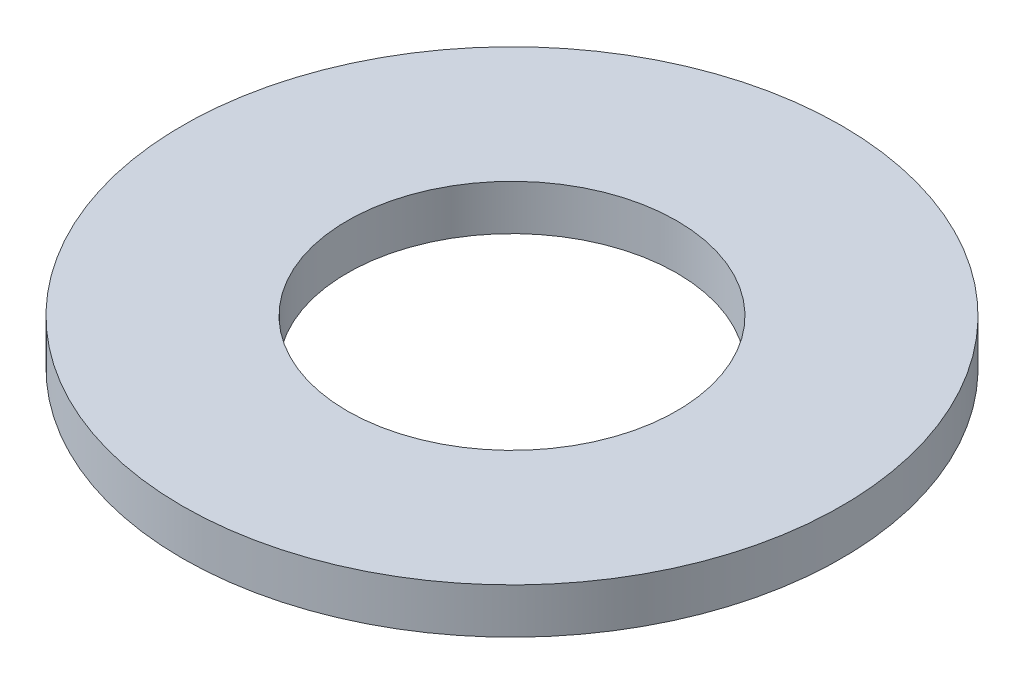
ISO-10303-21;
HEADER;
FILE_DESCRIPTION(('STEP AP214'),'2;1');
FILE_NAME('part.step','',(''),(''),'','','');
FILE_SCHEMA(('AUTOMOTIVE_DESIGN { 1 0 10303 214 1 1 1 1 }'));
ENDSEC;
DATA;
#1=APPLICATION_CONTEXT('core data for automotive mechanical design processes');
#2=APPLICATION_PROTOCOL_DEFINITION('international standard','automotive_design',2000,#1);
#3=PRODUCT_CONTEXT('',#1,'mechanical');
#4=PRODUCT('Part','Part','',(#3));
#5=PRODUCT_RELATED_PRODUCT_CATEGORY('part','',(#4));
#6=PRODUCT_DEFINITION_FORMATION('','',#4);
#7=PRODUCT_DEFINITION_CONTEXT('part definition',#1,'design');
#8=PRODUCT_DEFINITION('design','',#6,#7);
#9=PRODUCT_DEFINITION_SHAPE('','',#8);
#10=(LENGTH_UNIT() NAMED_UNIT(*) SI_UNIT(.MILLI.,.METRE.));
#11=(NAMED_UNIT(*) PLANE_ANGLE_UNIT() SI_UNIT($,.RADIAN.));
#12=(NAMED_UNIT(*) SI_UNIT($,.STERADIAN.) SOLID_ANGLE_UNIT());
#13=UNCERTAINTY_MEASURE_WITH_UNIT(LENGTH_MEASURE(1.E-05),#10,'distance_accuracy_value','');
#14=(GEOMETRIC_REPRESENTATION_CONTEXT(3) GLOBAL_UNCERTAINTY_ASSIGNED_CONTEXT((#13)) GLOBAL_UNIT_ASSIGNED_CONTEXT((#10,
#11,#12)) REPRESENTATION_CONTEXT('',''));
#15=CARTESIAN_POINT('',(0.,0.,0.));
#16=DIRECTION('',(0.,0.,1.));
#17=DIRECTION('',(1.,0.,0.));
#18=AXIS2_PLACEMENT_3D('',#15,#16,#17);
#19=CARTESIAN_POINT('',(0.,11.,0.));
#20=DIRECTION('',(0.,-1.,0.));
#21=DIRECTION('',(0.,0.,-1.));
#22=AXIS2_PLACEMENT_3D('',#19,#20,#21);
#23=CYLINDRICAL_SURFACE('',#22,80.);
#24=CARTESIAN_POINT('',(0.,11.,0.));
#25=DIRECTION('',(0.,1.,0.));
#26=DIRECTION('',(0.,0.,1.));
#27=AXIS2_PLACEMENT_3D('',#24,#25,#26);
#28=CIRCLE('',#27,80.);
#29=CARTESIAN_POINT('',(0.,11.,80.));
#30=VERTEX_POINT('',#29);
#31=EDGE_CURVE('E10',#30,#30,#28,.T.);
#32=ORIENTED_EDGE('',*,*,#31,.F.);
#33=EDGE_LOOP('',(#32));
#34=FACE_BOUND('',#33,.T.);
#35=CARTESIAN_POINT('',(0.,0.,0.));
#36=DIRECTION('',(0.,1.,0.));
#37=DIRECTION('',(0.,0.,1.));
#38=AXIS2_PLACEMENT_3D('',#35,#36,#37);
#39=CIRCLE('',#38,80.);
#40=CARTESIAN_POINT('',(0.,0.,80.));
#41=VERTEX_POINT('',#40);
#42=EDGE_CURVE('E37',#41,#41,#39,.T.);
#43=ORIENTED_EDGE('',*,*,#42,.T.);
#44=EDGE_LOOP('',(#43));
#45=FACE_BOUND('',#44,.T.);
#46=ADVANCED_FACE('F40',(#34,#45),#23,.T.);
#47=CARTESIAN_POINT('',(0.,11.,0.));
#48=DIRECTION('',(0.,1.,0.));
#49=DIRECTION('',(0.,0.,1.));
#50=AXIS2_PLACEMENT_3D('',#47,#48,#49);
#51=PLANE('',#50);
#52=CARTESIAN_POINT('',(0.,11.,0.));
#53=DIRECTION('',(0.,1.,0.));
#54=DIRECTION('',(0.,0.,1.));
#55=AXIS2_PLACEMENT_3D('',#52,#53,#54);
#56=CIRCLE('',#55,40.);
#57=CARTESIAN_POINT('',(0.,11.,40.));
#58=VERTEX_POINT('',#57);
#59=EDGE_CURVE('E50',#58,#58,#56,.T.);
#60=ORIENTED_EDGE('',*,*,#59,.F.);
#61=EDGE_LOOP('',(#60));
#62=FACE_BOUND('',#61,.T.);
#63=ORIENTED_EDGE('',*,*,#31,.T.);
#64=EDGE_LOOP('',(#63));
#65=FACE_BOUND('',#64,.T.);
#66=ADVANCED_FACE('F59',(#62,#65),#51,.T.);
#67=CARTESIAN_POINT('',(0.,0.,0.));
#68=DIRECTION('',(0.,1.,0.));
#69=DIRECTION('',(0.,0.,1.));
#70=AXIS2_PLACEMENT_3D('',#67,#68,#69);
#71=PLANE('',#70);
#72=CARTESIAN_POINT('',(0.,0.,0.));
#73=DIRECTION('',(0.,1.,0.));
#74=DIRECTION('',(0.,0.,1.));
#75=AXIS2_PLACEMENT_3D('',#72,#73,#74);
#76=CIRCLE('',#75,40.);
#77=CARTESIAN_POINT('',(0.,0.,40.));
#78=VERTEX_POINT('',#77);
#79=EDGE_CURVE('E47',#78,#78,#76,.T.);
#80=ORIENTED_EDGE('',*,*,#79,.T.);
#81=EDGE_LOOP('',(#80));
#82=FACE_BOUND('',#81,.T.);
#83=ORIENTED_EDGE('',*,*,#42,.F.);
#84=EDGE_LOOP('',(#83));
#85=FACE_BOUND('',#84,.T.);
#86=ADVANCED_FACE('F58',(#82,#85),#71,.F.);
#87=CARTESIAN_POINT('',(0.,11.,0.));
#88=DIRECTION('',(0.,-1.,0.));
#89=DIRECTION('',(0.,0.,-1.));
#90=AXIS2_PLACEMENT_3D('',#87,#88,#89);
#91=CYLINDRICAL_SURFACE('',#90,40.);
#92=ORIENTED_EDGE('',*,*,#59,.T.);
#93=EDGE_LOOP('',(#92));
#94=FACE_BOUND('',#93,.T.);
#95=ORIENTED_EDGE('',*,*,#79,.F.);
#96=EDGE_LOOP('',(#95));
#97=FACE_BOUND('',#96,.T.);
#98=ADVANCED_FACE('F54',(#94,#97),#91,.F.);
#99=CLOSED_SHELL('',(#46,#66,#86,#98));
#100=MANIFOLD_SOLID_BREP('B2',#99);
#101=ADVANCED_BREP_SHAPE_REPRESENTATION('',(#18,#100),#14);
#102=SHAPE_DEFINITION_REPRESENTATION(#9,#101);
ENDSEC;
END-ISO-10303-21;
